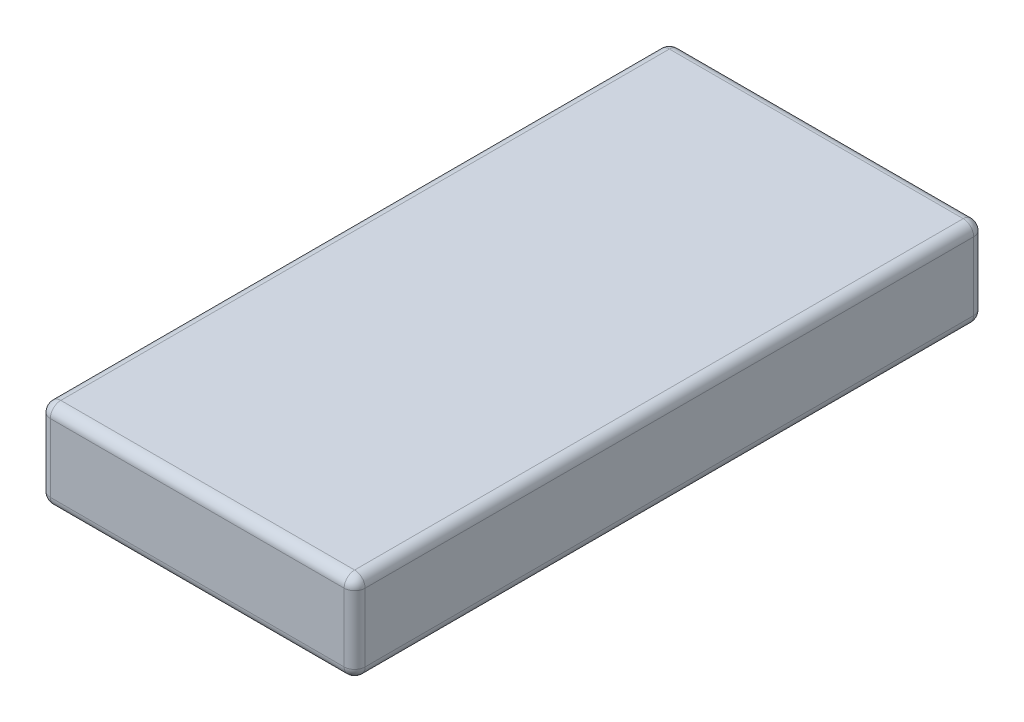
ISO-10303-21;
HEADER;
FILE_DESCRIPTION(('STEP AP214'),'2;1');
FILE_NAME('part.step','',(''),(''),'','','');
FILE_SCHEMA(('AUTOMOTIVE_DESIGN { 1 0 10303 214 1 1 1 1 }'));
ENDSEC;
DATA;
#1=APPLICATION_CONTEXT('core data for automotive mechanical design processes');
#2=APPLICATION_PROTOCOL_DEFINITION('international standard','automotive_design',2000,#1);
#3=PRODUCT_CONTEXT('',#1,'mechanical');
#4=PRODUCT('Part','Part','',(#3));
#5=PRODUCT_RELATED_PRODUCT_CATEGORY('part','',(#4));
#6=PRODUCT_DEFINITION_FORMATION('','',#4);
#7=PRODUCT_DEFINITION_CONTEXT('part definition',#1,'design');
#8=PRODUCT_DEFINITION('design','',#6,#7);
#9=PRODUCT_DEFINITION_SHAPE('','',#8);
#10=(LENGTH_UNIT() NAMED_UNIT(*) SI_UNIT(.MILLI.,.METRE.));
#11=(NAMED_UNIT(*) PLANE_ANGLE_UNIT() SI_UNIT($,.RADIAN.));
#12=(NAMED_UNIT(*) SI_UNIT($,.STERADIAN.) SOLID_ANGLE_UNIT());
#13=UNCERTAINTY_MEASURE_WITH_UNIT(LENGTH_MEASURE(1.E-05),#10,'distance_accuracy_value','');
#14=(GEOMETRIC_REPRESENTATION_CONTEXT(3) GLOBAL_UNCERTAINTY_ASSIGNED_CONTEXT((#13)) GLOBAL_UNIT_ASSIGNED_CONTEXT((#10,
#11,#12)) REPRESENTATION_CONTEXT('',''));
#15=CARTESIAN_POINT('',(0.,0.,0.));
#16=DIRECTION('',(0.,0.,1.));
#17=DIRECTION('',(1.,0.,0.));
#18=AXIS2_PLACEMENT_3D('',#15,#16,#17);
#19=CARTESIAN_POINT('',(-1.5,0.85,3.));
#20=DIRECTION('',(1.,0.,0.));
#21=DIRECTION('',(0.,0.,-1.));
#22=AXIS2_PLACEMENT_3D('',#19,#20,#21);
#23=PLANE('',#22);
#24=DIRECTION('',(0.,0.,1.));
#25=VECTOR('',#24,1.);
#26=CARTESIAN_POINT('',(-1.5,0.75,-3.));
#27=LINE('',#26,#25);
#28=CARTESIAN_POINT('',(-1.5,0.75,2.9));
#29=VERTEX_POINT('',#28);
#30=CARTESIAN_POINT('',(-1.5,0.75,-2.9));
#31=VERTEX_POINT('',#30);
#32=EDGE_CURVE('E184',#29,#31,#27,.F.);
#33=ORIENTED_EDGE('',*,*,#32,.T.);
#34=DIRECTION('',(0.,-1.,0.));
#35=VECTOR('',#34,1.);
#36=CARTESIAN_POINT('',(-1.5,0.85,-2.9));
#37=LINE('',#36,#35);
#38=CARTESIAN_POINT('',(-1.5,0.1,-2.9));
#39=VERTEX_POINT('',#38);
#40=EDGE_CURVE('E186',#31,#39,#37,.T.);
#41=ORIENTED_EDGE('',*,*,#40,.T.);
#42=DIRECTION('',(0.,0.,1.));
#43=VECTOR('',#42,1.);
#44=CARTESIAN_POINT('',(-1.5,0.1,3.));
#45=LINE('',#44,#43);
#46=CARTESIAN_POINT('',(-1.5,0.1,2.9));
#47=VERTEX_POINT('',#46);
#48=EDGE_CURVE('E182',#39,#47,#45,.T.);
#49=ORIENTED_EDGE('',*,*,#48,.T.);
#50=DIRECTION('',(0.,-1.,0.));
#51=VECTOR('',#50,1.);
#52=CARTESIAN_POINT('',(-1.5,0.85,2.9));
#53=LINE('',#52,#51);
#54=EDGE_CURVE('E180',#47,#29,#53,.F.);
#55=ORIENTED_EDGE('',*,*,#54,.T.);
#56=EDGE_LOOP('',(#33,#41,#49,#55));
#57=FACE_BOUND('',#56,.T.);
#58=ADVANCED_FACE('F32',(#57),#23,.F.);
#59=CARTESIAN_POINT('',(1.5,0.85,3.));
#60=DIRECTION('',(0.,0.,-1.));
#61=DIRECTION('',(-1.,0.,0.));
#62=AXIS2_PLACEMENT_3D('',#59,#60,#61);
#63=PLANE('',#62);
#64=DIRECTION('',(1.,0.,0.));
#65=VECTOR('',#64,1.);
#66=CARTESIAN_POINT('',(-1.5,0.75,3.));
#67=LINE('',#66,#65);
#68=CARTESIAN_POINT('',(1.4,0.75,3.));
#69=VERTEX_POINT('',#68);
#70=CARTESIAN_POINT('',(-1.4,0.75,3.));
#71=VERTEX_POINT('',#70);
#72=EDGE_CURVE('E137',#69,#71,#67,.F.);
#73=ORIENTED_EDGE('',*,*,#72,.T.);
#74=DIRECTION('',(0.,-1.,0.));
#75=VECTOR('',#74,1.);
#76=CARTESIAN_POINT('',(-1.4,0.85,3.));
#77=LINE('',#76,#75);
#78=CARTESIAN_POINT('',(-1.4,0.1,3.));
#79=VERTEX_POINT('',#78);
#80=EDGE_CURVE('E194',#71,#79,#77,.T.);
#81=ORIENTED_EDGE('',*,*,#80,.T.);
#82=DIRECTION('',(1.,0.,0.));
#83=VECTOR('',#82,1.);
#84=CARTESIAN_POINT('',(1.5,0.1,3.));
#85=LINE('',#84,#83);
#86=CARTESIAN_POINT('',(1.4,0.1,3.));
#87=VERTEX_POINT('',#86);
#88=EDGE_CURVE('E191',#79,#87,#85,.T.);
#89=ORIENTED_EDGE('',*,*,#88,.T.);
#90=DIRECTION('',(0.,-1.,0.));
#91=VECTOR('',#90,1.);
#92=CARTESIAN_POINT('',(1.4,0.85,3.));
#93=LINE('',#92,#91);
#94=EDGE_CURVE('E189',#87,#69,#93,.F.);
#95=ORIENTED_EDGE('',*,*,#94,.T.);
#96=EDGE_LOOP('',(#73,#81,#89,#95));
#97=FACE_BOUND('',#96,.T.);
#98=ADVANCED_FACE('F262',(#97),#63,.F.);
#99=CARTESIAN_POINT('',(1.5,0.85,3.));
#100=DIRECTION('',(-1.,0.,0.));
#101=DIRECTION('',(0.,0.,1.));
#102=AXIS2_PLACEMENT_3D('',#99,#100,#101);
#103=PLANE('',#102);
#104=DIRECTION('',(0.,0.,-1.));
#105=VECTOR('',#104,1.);
#106=CARTESIAN_POINT('',(1.5,0.75,3.));
#107=LINE('',#106,#105);
#108=CARTESIAN_POINT('',(1.5,0.75,-2.9));
#109=VERTEX_POINT('',#108);
#110=CARTESIAN_POINT('',(1.5,0.75,2.9));
#111=VERTEX_POINT('',#110);
#112=EDGE_CURVE('E41',#109,#111,#107,.F.);
#113=ORIENTED_EDGE('',*,*,#112,.T.);
#114=DIRECTION('',(0.,-1.,0.));
#115=VECTOR('',#114,1.);
#116=CARTESIAN_POINT('',(1.5,0.85,2.9));
#117=LINE('',#116,#115);
#118=CARTESIAN_POINT('',(1.5,0.1,2.9));
#119=VERTEX_POINT('',#118);
#120=EDGE_CURVE('E11',#111,#119,#117,.T.);
#121=ORIENTED_EDGE('',*,*,#120,.T.);
#122=DIRECTION('',(0.,0.,-1.));
#123=VECTOR('',#122,1.);
#124=CARTESIAN_POINT('',(1.5,0.1,3.));
#125=LINE('',#124,#123);
#126=CARTESIAN_POINT('',(1.5,0.1,-2.9));
#127=VERTEX_POINT('',#126);
#128=EDGE_CURVE('E197',#119,#127,#125,.T.);
#129=ORIENTED_EDGE('',*,*,#128,.T.);
#130=DIRECTION('',(0.,-1.,0.));
#131=VECTOR('',#130,1.);
#132=CARTESIAN_POINT('',(1.5,0.85,-2.9));
#133=LINE('',#132,#131);
#134=EDGE_CURVE('E52',#127,#109,#133,.F.);
#135=ORIENTED_EDGE('',*,*,#134,.T.);
#136=EDGE_LOOP('',(#113,#121,#129,#135));
#137=FACE_BOUND('',#136,.T.);
#138=ADVANCED_FACE('F307',(#137),#103,.F.);
#139=CARTESIAN_POINT('',(1.5,0.85,-3.));
#140=DIRECTION('',(0.,0.,1.));
#141=DIRECTION('',(1.,0.,0.));
#142=AXIS2_PLACEMENT_3D('',#139,#140,#141);
#143=PLANE('',#142);
#144=DIRECTION('',(-1.,0.,0.));
#145=VECTOR('',#144,1.);
#146=CARTESIAN_POINT('',(1.5,0.1,-3.));
#147=LINE('',#146,#145);
#148=CARTESIAN_POINT('',(1.4,0.1,-3.));
#149=VERTEX_POINT('',#148);
#150=CARTESIAN_POINT('',(-1.4,0.1,-3.));
#151=VERTEX_POINT('',#150);
#152=EDGE_CURVE('E164',#149,#151,#147,.T.);
#153=ORIENTED_EDGE('',*,*,#152,.T.);
#154=DIRECTION('',(0.,-1.,0.));
#155=VECTOR('',#154,1.);
#156=CARTESIAN_POINT('',(-1.4,0.85,-3.));
#157=LINE('',#156,#155);
#158=CARTESIAN_POINT('',(-1.4,0.75,-3.));
#159=VERTEX_POINT('',#158);
#160=EDGE_CURVE('E169',#151,#159,#157,.F.);
#161=ORIENTED_EDGE('',*,*,#160,.T.);
#162=DIRECTION('',(-1.,0.,0.));
#163=VECTOR('',#162,1.);
#164=CARTESIAN_POINT('',(1.5,0.75,-3.));
#165=LINE('',#164,#163);
#166=CARTESIAN_POINT('',(1.4,0.75,-3.));
#167=VERTEX_POINT('',#166);
#168=EDGE_CURVE('E166',#159,#167,#165,.F.);
#169=ORIENTED_EDGE('',*,*,#168,.T.);
#170=DIRECTION('',(0.,-1.,0.));
#171=VECTOR('',#170,1.);
#172=CARTESIAN_POINT('',(1.4,0.85,-3.));
#173=LINE('',#172,#171);
#174=EDGE_CURVE('E162',#167,#149,#173,.T.);
#175=ORIENTED_EDGE('',*,*,#174,.T.);
#176=EDGE_LOOP('',(#153,#161,#169,#175));
#177=FACE_BOUND('',#176,.T.);
#178=ADVANCED_FACE('F309',(#177),#143,.F.);
#179=CARTESIAN_POINT('',(0.,0.85,0.));
#180=DIRECTION('',(0.,1.,0.));
#181=DIRECTION('',(0.,0.,1.));
#182=AXIS2_PLACEMENT_3D('',#179,#180,#181);
#183=PLANE('',#182);
#184=DIRECTION('',(0.,0.,-1.));
#185=VECTOR('',#184,1.);
#186=CARTESIAN_POINT('',(1.4,0.85,-3.));
#187=LINE('',#186,#185);
#188=CARTESIAN_POINT('',(1.4,0.85,2.9));
#189=VERTEX_POINT('',#188);
#190=CARTESIAN_POINT('',(1.4,0.85,-2.9));
#191=VERTEX_POINT('',#190);
#192=EDGE_CURVE('E124',#189,#191,#187,.T.);
#193=ORIENTED_EDGE('',*,*,#192,.T.);
#194=DIRECTION('',(-1.,0.,0.));
#195=VECTOR('',#194,1.);
#196=CARTESIAN_POINT('',(-1.5,0.85,-2.9));
#197=LINE('',#196,#195);
#198=CARTESIAN_POINT('',(-1.4,0.85,-2.9));
#199=VERTEX_POINT('',#198);
#200=EDGE_CURVE('E160',#191,#199,#197,.T.);
#201=ORIENTED_EDGE('',*,*,#200,.T.);
#202=DIRECTION('',(0.,0.,1.));
#203=VECTOR('',#202,1.);
#204=CARTESIAN_POINT('',(-1.4,0.85,3.));
#205=LINE('',#204,#203);
#206=CARTESIAN_POINT('',(-1.4,0.85,2.9));
#207=VERTEX_POINT('',#206);
#208=EDGE_CURVE('E127',#199,#207,#205,.T.);
#209=ORIENTED_EDGE('',*,*,#208,.T.);
#210=DIRECTION('',(1.,0.,0.));
#211=VECTOR('',#210,1.);
#212=CARTESIAN_POINT('',(1.5,0.85,2.9));
#213=LINE('',#212,#211);
#214=EDGE_CURVE('E119',#207,#189,#213,.T.);
#215=ORIENTED_EDGE('',*,*,#214,.T.);
#216=EDGE_LOOP('',(#193,#201,#209,#215));
#217=FACE_BOUND('',#216,.T.);
#218=ADVANCED_FACE('F121',(#217),#183,.T.);
#219=CARTESIAN_POINT('',(0.,0.,0.));
#220=DIRECTION('',(0.,1.,0.));
#221=DIRECTION('',(0.,0.,1.));
#222=AXIS2_PLACEMENT_3D('',#219,#220,#221);
#223=PLANE('',#222);
#224=DIRECTION('',(0.,0.,1.));
#225=VECTOR('',#224,1.);
#226=CARTESIAN_POINT('',(-1.4,0.,0.));
#227=LINE('',#226,#225);
#228=CARTESIAN_POINT('',(-1.4,0.,2.9));
#229=VERTEX_POINT('',#228);
#230=CARTESIAN_POINT('',(-1.4,0.,-2.9));
#231=VERTEX_POINT('',#230);
#232=EDGE_CURVE('E175',#229,#231,#227,.F.);
#233=ORIENTED_EDGE('',*,*,#232,.T.);
#234=DIRECTION('',(-1.,0.,0.));
#235=VECTOR('',#234,1.);
#236=CARTESIAN_POINT('',(0.,0.,-2.9));
#237=LINE('',#236,#235);
#238=CARTESIAN_POINT('',(1.4,0.,-2.9));
#239=VERTEX_POINT('',#238);
#240=EDGE_CURVE('E177',#231,#239,#237,.F.);
#241=ORIENTED_EDGE('',*,*,#240,.T.);
#242=DIRECTION('',(0.,0.,-1.));
#243=VECTOR('',#242,1.);
#244=CARTESIAN_POINT('',(1.4,0.,0.));
#245=LINE('',#244,#243);
#246=CARTESIAN_POINT('',(1.4,0.,2.9));
#247=VERTEX_POINT('',#246);
#248=EDGE_CURVE('E171',#239,#247,#245,.F.);
#249=ORIENTED_EDGE('',*,*,#248,.T.);
#250=DIRECTION('',(1.,0.,0.));
#251=VECTOR('',#250,1.);
#252=CARTESIAN_POINT('',(0.,0.,2.9));
#253=LINE('',#252,#251);
#254=EDGE_CURVE('E173',#247,#229,#253,.F.);
#255=ORIENTED_EDGE('',*,*,#254,.T.);
#256=EDGE_LOOP('',(#233,#241,#249,#255));
#257=FACE_BOUND('',#256,.T.);
#258=ADVANCED_FACE('F290',(#257),#223,.F.);
#259=CARTESIAN_POINT('',(1.5,0.1,2.9));
#260=DIRECTION('',(1.,0.,0.));
#261=DIRECTION('',(0.,0.,-1.));
#262=AXIS2_PLACEMENT_3D('',#259,#260,#261);
#263=CYLINDRICAL_SURFACE('',#262,0.1);
#264=CARTESIAN_POINT('',(1.4,0.1,2.9));
#265=DIRECTION('',(1.,0.,0.));
#266=DIRECTION('',(0.,0.,-1.));
#267=AXIS2_PLACEMENT_3D('',#264,#265,#266);
#268=CIRCLE('',#267,0.1);
#269=EDGE_CURVE('E36',#87,#247,#268,.T.);
#270=ORIENTED_EDGE('',*,*,#269,.F.);
#271=ORIENTED_EDGE('',*,*,#88,.F.);
#272=CARTESIAN_POINT('',(-1.4,0.1,2.9));
#273=DIRECTION('',(-1.,0.,0.));
#274=DIRECTION('',(0.,0.,1.));
#275=AXIS2_PLACEMENT_3D('',#272,#273,#274);
#276=CIRCLE('',#275,0.1);
#277=EDGE_CURVE('E157',#229,#79,#276,.T.);
#278=ORIENTED_EDGE('',*,*,#277,.F.);
#279=ORIENTED_EDGE('',*,*,#254,.F.);
#280=EDGE_LOOP('',(#270,#271,#278,#279));
#281=FACE_BOUND('',#280,.T.);
#282=ADVANCED_FACE('F34',(#281),#263,.T.);
#283=CARTESIAN_POINT('',(1.4,0.1,2.9));
#284=DIRECTION('',(0.,0.,1.));
#285=DIRECTION('',(1.,0.,0.));
#286=AXIS2_PLACEMENT_3D('',#283,#284,#285);
#287=SPHERICAL_SURFACE('',#286,0.1);
#288=CARTESIAN_POINT('',(1.4,0.1,2.9));
#289=DIRECTION('',(0.,-1.,0.));
#290=DIRECTION('',(0.,0.,-1.));
#291=AXIS2_PLACEMENT_3D('',#288,#289,#290);
#292=CIRCLE('',#291,0.1);
#293=EDGE_CURVE('E242',#87,#119,#292,.F.);
#294=ORIENTED_EDGE('',*,*,#293,.F.);
#295=ORIENTED_EDGE('',*,*,#269,.T.);
#296=CARTESIAN_POINT('',(1.4,0.1,2.9));
#297=DIRECTION('',(0.,0.,1.));
#298=DIRECTION('',(1.,0.,0.));
#299=AXIS2_PLACEMENT_3D('',#296,#297,#298);
#300=CIRCLE('',#299,0.1);
#301=EDGE_CURVE('E245',#119,#247,#300,.F.);
#302=ORIENTED_EDGE('',*,*,#301,.F.);
#303=EDGE_LOOP('',(#294,#295,#302));
#304=FACE_BOUND('',#303,.T.);
#305=ADVANCED_FACE('F303',(#304),#287,.T.);
#306=CARTESIAN_POINT('',(-1.4,0.1,2.9));
#307=DIRECTION('',(0.,0.,1.));
#308=DIRECTION('',(1.,0.,0.));
#309=AXIS2_PLACEMENT_3D('',#306,#307,#308);
#310=SPHERICAL_SURFACE('',#309,0.1);
#311=CARTESIAN_POINT('',(-1.4,0.1,2.9));
#312=DIRECTION('',(0.,0.,1.));
#313=DIRECTION('',(1.,0.,0.));
#314=AXIS2_PLACEMENT_3D('',#311,#312,#313);
#315=CIRCLE('',#314,0.1);
#316=EDGE_CURVE('E237',#229,#47,#315,.F.);
#317=ORIENTED_EDGE('',*,*,#316,.F.);
#318=ORIENTED_EDGE('',*,*,#277,.T.);
#319=CARTESIAN_POINT('',(-1.4,0.1,2.9));
#320=DIRECTION('',(0.,-1.,0.));
#321=DIRECTION('',(0.,0.,-1.));
#322=AXIS2_PLACEMENT_3D('',#319,#320,#321);
#323=CIRCLE('',#322,0.1);
#324=EDGE_CURVE('E240',#47,#79,#323,.F.);
#325=ORIENTED_EDGE('',*,*,#324,.F.);
#326=EDGE_LOOP('',(#317,#318,#325));
#327=FACE_BOUND('',#326,.T.);
#328=ADVANCED_FACE('F253',(#327),#310,.T.);
#329=CARTESIAN_POINT('',(1.4,0.1,3.));
#330=DIRECTION('',(0.,0.,-1.));
#331=DIRECTION('',(-1.,0.,0.));
#332=AXIS2_PLACEMENT_3D('',#329,#330,#331);
#333=CYLINDRICAL_SURFACE('',#332,0.1);
#334=ORIENTED_EDGE('',*,*,#301,.T.);
#335=ORIENTED_EDGE('',*,*,#248,.F.);
#336=CARTESIAN_POINT('',(1.4,0.1,-2.9));
#337=DIRECTION('',(0.,0.,-1.));
#338=DIRECTION('',(-1.,0.,0.));
#339=AXIS2_PLACEMENT_3D('',#336,#337,#338);
#340=CIRCLE('',#339,0.1);
#341=EDGE_CURVE('E232',#127,#239,#340,.T.);
#342=ORIENTED_EDGE('',*,*,#341,.F.);
#343=ORIENTED_EDGE('',*,*,#128,.F.);
#344=EDGE_LOOP('',(#334,#335,#342,#343));
#345=FACE_BOUND('',#344,.T.);
#346=ADVANCED_FACE('F300',(#345),#333,.T.);
#347=CARTESIAN_POINT('',(1.4,0.85,2.9));
#348=DIRECTION('',(0.,-1.,0.));
#349=DIRECTION('',(0.,0.,-1.));
#350=AXIS2_PLACEMENT_3D('',#347,#348,#349);
#351=CYLINDRICAL_SURFACE('',#350,0.1);
#352=ORIENTED_EDGE('',*,*,#293,.T.);
#353=ORIENTED_EDGE('',*,*,#120,.F.);
#354=CARTESIAN_POINT('',(1.4,0.75,2.9));
#355=DIRECTION('',(0.,1.,0.));
#356=DIRECTION('',(0.,0.,1.));
#357=AXIS2_PLACEMENT_3D('',#354,#355,#356);
#358=CIRCLE('',#357,0.1);
#359=EDGE_CURVE('E141',#69,#111,#358,.T.);
#360=ORIENTED_EDGE('',*,*,#359,.F.);
#361=ORIENTED_EDGE('',*,*,#94,.F.);
#362=EDGE_LOOP('',(#352,#353,#360,#361));
#363=FACE_BOUND('',#362,.T.);
#364=ADVANCED_FACE('F306',(#363),#351,.T.);
#365=CARTESIAN_POINT('',(0.,0.75,2.9));
#366=DIRECTION('',(-1.,0.,0.));
#367=DIRECTION('',(0.,0.,1.));
#368=AXIS2_PLACEMENT_3D('',#365,#366,#367);
#369=CYLINDRICAL_SURFACE('',#368,0.1);
#370=CARTESIAN_POINT('',(-1.4,0.75,2.9));
#371=DIRECTION('',(-1.,0.,0.));
#372=DIRECTION('',(0.,-1.,0.));
#373=AXIS2_PLACEMENT_3D('',#370,#371,#372);
#374=CIRCLE('',#373,0.1);
#375=EDGE_CURVE('E142',#71,#207,#374,.T.);
#376=ORIENTED_EDGE('',*,*,#375,.F.);
#377=ORIENTED_EDGE('',*,*,#72,.F.);
#378=CARTESIAN_POINT('',(1.4,0.75,2.9));
#379=DIRECTION('',(1.,0.,0.));
#380=DIRECTION('',(0.,0.,-1.));
#381=AXIS2_PLACEMENT_3D('',#378,#379,#380);
#382=CIRCLE('',#381,0.1);
#383=EDGE_CURVE('E134',#189,#69,#382,.T.);
#384=ORIENTED_EDGE('',*,*,#383,.F.);
#385=ORIENTED_EDGE('',*,*,#214,.F.);
#386=EDGE_LOOP('',(#376,#377,#384,#385));
#387=FACE_BOUND('',#386,.T.);
#388=ADVANCED_FACE('F136',(#387),#369,.T.);
#389=CARTESIAN_POINT('',(-1.4,0.85,2.9));
#390=DIRECTION('',(0.,-1.,0.));
#391=DIRECTION('',(0.,0.,-1.));
#392=AXIS2_PLACEMENT_3D('',#389,#390,#391);
#393=CYLINDRICAL_SURFACE('',#392,0.1);
#394=ORIENTED_EDGE('',*,*,#324,.T.);
#395=ORIENTED_EDGE('',*,*,#80,.F.);
#396=CARTESIAN_POINT('',(-1.4,0.75,2.9));
#397=DIRECTION('',(0.,1.,0.));
#398=DIRECTION('',(0.,0.,1.));
#399=AXIS2_PLACEMENT_3D('',#396,#397,#398);
#400=CIRCLE('',#399,0.1);
#401=EDGE_CURVE('E227',#29,#71,#400,.T.);
#402=ORIENTED_EDGE('',*,*,#401,.F.);
#403=ORIENTED_EDGE('',*,*,#54,.F.);
#404=EDGE_LOOP('',(#394,#395,#402,#403));
#405=FACE_BOUND('',#404,.T.);
#406=ADVANCED_FACE('F265',(#405),#393,.T.);
#407=CARTESIAN_POINT('',(-1.4,0.1,3.));
#408=DIRECTION('',(0.,0.,1.));
#409=DIRECTION('',(1.,0.,0.));
#410=AXIS2_PLACEMENT_3D('',#407,#408,#409);
#411=CYLINDRICAL_SURFACE('',#410,0.1);
#412=ORIENTED_EDGE('',*,*,#316,.T.);
#413=ORIENTED_EDGE('',*,*,#48,.F.);
#414=CARTESIAN_POINT('',(-1.4,0.1,-2.9));
#415=DIRECTION('',(0.,0.,-1.));
#416=DIRECTION('',(-1.,0.,0.));
#417=AXIS2_PLACEMENT_3D('',#414,#415,#416);
#418=CIRCLE('',#417,0.1);
#419=EDGE_CURVE('E224',#231,#39,#418,.T.);
#420=ORIENTED_EDGE('',*,*,#419,.F.);
#421=ORIENTED_EDGE('',*,*,#232,.F.);
#422=EDGE_LOOP('',(#412,#413,#420,#421));
#423=FACE_BOUND('',#422,.T.);
#424=ADVANCED_FACE('F287',(#423),#411,.T.);
#425=CARTESIAN_POINT('',(1.5,0.1,-2.9));
#426=DIRECTION('',(-1.,0.,0.));
#427=DIRECTION('',(0.,0.,1.));
#428=AXIS2_PLACEMENT_3D('',#425,#426,#427);
#429=CYLINDRICAL_SURFACE('',#428,0.1);
#430=CARTESIAN_POINT('',(1.4,0.1,-2.9));
#431=DIRECTION('',(1.,0.,0.));
#432=DIRECTION('',(0.,0.,-1.));
#433=AXIS2_PLACEMENT_3D('',#430,#431,#432);
#434=CIRCLE('',#433,0.1);
#435=EDGE_CURVE('E234',#239,#149,#434,.T.);
#436=ORIENTED_EDGE('',*,*,#435,.F.);
#437=ORIENTED_EDGE('',*,*,#240,.F.);
#438=CARTESIAN_POINT('',(-1.4,0.1,-2.9));
#439=DIRECTION('',(-1.,0.,0.));
#440=DIRECTION('',(0.,0.,1.));
#441=AXIS2_PLACEMENT_3D('',#438,#439,#440);
#442=CIRCLE('',#441,0.1);
#443=EDGE_CURVE('E221',#151,#231,#442,.T.);
#444=ORIENTED_EDGE('',*,*,#443,.F.);
#445=ORIENTED_EDGE('',*,*,#152,.F.);
#446=EDGE_LOOP('',(#436,#437,#444,#445));
#447=FACE_BOUND('',#446,.T.);
#448=ADVANCED_FACE('F293',(#447),#429,.T.);
#449=CARTESIAN_POINT('',(1.4,0.1,-2.9));
#450=DIRECTION('',(0.,0.,1.));
#451=DIRECTION('',(1.,0.,0.));
#452=AXIS2_PLACEMENT_3D('',#449,#450,#451);
#453=SPHERICAL_SURFACE('',#452,0.1);
#454=ORIENTED_EDGE('',*,*,#341,.T.);
#455=ORIENTED_EDGE('',*,*,#435,.T.);
#456=CARTESIAN_POINT('',(1.4,0.1,-2.9));
#457=DIRECTION('',(0.,-1.,0.));
#458=DIRECTION('',(0.,0.,-1.));
#459=AXIS2_PLACEMENT_3D('',#456,#457,#458);
#460=CIRCLE('',#459,0.1);
#461=EDGE_CURVE('E148',#127,#149,#460,.F.);
#462=ORIENTED_EDGE('',*,*,#461,.F.);
#463=EDGE_LOOP('',(#454,#455,#462));
#464=FACE_BOUND('',#463,.T.);
#465=ADVANCED_FACE('F351',(#464),#453,.T.);
#466=CARTESIAN_POINT('',(1.4,0.75,2.9));
#467=DIRECTION('',(0.,0.,1.));
#468=DIRECTION('',(1.,0.,0.));
#469=AXIS2_PLACEMENT_3D('',#466,#467,#468);
#470=SPHERICAL_SURFACE('',#469,0.1);
#471=ORIENTED_EDGE('',*,*,#383,.T.);
#472=ORIENTED_EDGE('',*,*,#359,.T.);
#473=CARTESIAN_POINT('',(1.4,0.75,2.9));
#474=DIRECTION('',(0.,0.,1.));
#475=DIRECTION('',(1.,0.,0.));
#476=AXIS2_PLACEMENT_3D('',#473,#474,#475);
#477=CIRCLE('',#476,0.1);
#478=EDGE_CURVE('E145',#189,#111,#477,.F.);
#479=ORIENTED_EDGE('',*,*,#478,.F.);
#480=EDGE_LOOP('',(#471,#472,#479));
#481=FACE_BOUND('',#480,.T.);
#482=ADVANCED_FACE('F146',(#481),#470,.T.);
#483=CARTESIAN_POINT('',(-1.4,0.75,2.9));
#484=DIRECTION('',(0.,0.,1.));
#485=DIRECTION('',(1.,0.,0.));
#486=AXIS2_PLACEMENT_3D('',#483,#484,#485);
#487=SPHERICAL_SURFACE('',#486,0.1);
#488=ORIENTED_EDGE('',*,*,#401,.T.);
#489=ORIENTED_EDGE('',*,*,#375,.T.);
#490=CARTESIAN_POINT('',(-1.4,0.75,2.9));
#491=DIRECTION('',(0.,0.,1.));
#492=DIRECTION('',(1.,0.,0.));
#493=AXIS2_PLACEMENT_3D('',#490,#491,#492);
#494=CIRCLE('',#493,0.1);
#495=EDGE_CURVE('E149',#29,#207,#494,.F.);
#496=ORIENTED_EDGE('',*,*,#495,.F.);
#497=EDGE_LOOP('',(#488,#489,#496));
#498=FACE_BOUND('',#497,.T.);
#499=ADVANCED_FACE('F268',(#498),#487,.T.);
#500=CARTESIAN_POINT('',(-1.4,0.1,-2.9));
#501=DIRECTION('',(0.,0.,1.));
#502=DIRECTION('',(1.,0.,0.));
#503=AXIS2_PLACEMENT_3D('',#500,#501,#502);
#504=SPHERICAL_SURFACE('',#503,0.1);
#505=ORIENTED_EDGE('',*,*,#443,.T.);
#506=ORIENTED_EDGE('',*,*,#419,.T.);
#507=CARTESIAN_POINT('',(-1.4,0.1,-2.9));
#508=DIRECTION('',(0.,-1.,0.));
#509=DIRECTION('',(0.,0.,-1.));
#510=AXIS2_PLACEMENT_3D('',#507,#508,#509);
#511=CIRCLE('',#510,0.1);
#512=EDGE_CURVE('E215',#151,#39,#511,.F.);
#513=ORIENTED_EDGE('',*,*,#512,.F.);
#514=EDGE_LOOP('',(#505,#506,#513));
#515=FACE_BOUND('',#514,.T.);
#516=ADVANCED_FACE('F284',(#515),#504,.T.);
#517=CARTESIAN_POINT('',(1.4,0.85,-2.9));
#518=DIRECTION('',(0.,-1.,0.));
#519=DIRECTION('',(0.,0.,-1.));
#520=AXIS2_PLACEMENT_3D('',#517,#518,#519);
#521=CYLINDRICAL_SURFACE('',#520,0.1);
#522=ORIENTED_EDGE('',*,*,#461,.T.);
#523=ORIENTED_EDGE('',*,*,#174,.F.);
#524=CARTESIAN_POINT('',(1.4,0.75,-2.9));
#525=DIRECTION('',(0.,1.,0.));
#526=DIRECTION('',(0.,0.,1.));
#527=AXIS2_PLACEMENT_3D('',#524,#525,#526);
#528=CIRCLE('',#527,0.1);
#529=EDGE_CURVE('E212',#109,#167,#528,.T.);
#530=ORIENTED_EDGE('',*,*,#529,.F.);
#531=ORIENTED_EDGE('',*,*,#134,.F.);
#532=EDGE_LOOP('',(#522,#523,#530,#531));
#533=FACE_BOUND('',#532,.T.);
#534=ADVANCED_FACE('F341',(#533),#521,.T.);
#535=CARTESIAN_POINT('',(1.4,0.75,0.));
#536=DIRECTION('',(0.,0.,1.));
#537=DIRECTION('',(1.,0.,0.));
#538=AXIS2_PLACEMENT_3D('',#535,#536,#537);
#539=CYLINDRICAL_SURFACE('',#538,0.1);
#540=ORIENTED_EDGE('',*,*,#478,.T.);
#541=ORIENTED_EDGE('',*,*,#112,.F.);
#542=CARTESIAN_POINT('',(1.4,0.75,-2.9));
#543=DIRECTION('',(0.,0.,-1.));
#544=DIRECTION('',(-1.,0.,0.));
#545=AXIS2_PLACEMENT_3D('',#542,#543,#544);
#546=CIRCLE('',#545,0.1);
#547=EDGE_CURVE('E153',#191,#109,#546,.T.);
#548=ORIENTED_EDGE('',*,*,#547,.F.);
#549=ORIENTED_EDGE('',*,*,#192,.F.);
#550=EDGE_LOOP('',(#540,#541,#548,#549));
#551=FACE_BOUND('',#550,.T.);
#552=ADVANCED_FACE('F151',(#551),#539,.T.);
#553=CARTESIAN_POINT('',(-1.4,0.75,0.));
#554=DIRECTION('',(0.,0.,-1.));
#555=DIRECTION('',(-1.,0.,0.));
#556=AXIS2_PLACEMENT_3D('',#553,#554,#555);
#557=CYLINDRICAL_SURFACE('',#556,0.1);
#558=ORIENTED_EDGE('',*,*,#495,.T.);
#559=ORIENTED_EDGE('',*,*,#208,.F.);
#560=CARTESIAN_POINT('',(-1.4,0.75,-2.9));
#561=DIRECTION('',(0.,0.,-1.));
#562=DIRECTION('',(0.,1.,0.));
#563=AXIS2_PLACEMENT_3D('',#560,#561,#562);
#564=CIRCLE('',#563,0.1);
#565=EDGE_CURVE('E208',#31,#199,#564,.T.);
#566=ORIENTED_EDGE('',*,*,#565,.F.);
#567=ORIENTED_EDGE('',*,*,#32,.F.);
#568=EDGE_LOOP('',(#558,#559,#566,#567));
#569=FACE_BOUND('',#568,.T.);
#570=ADVANCED_FACE('F272',(#569),#557,.T.);
#571=CARTESIAN_POINT('',(-1.4,0.85,-2.9));
#572=DIRECTION('',(0.,-1.,0.));
#573=DIRECTION('',(0.,0.,-1.));
#574=AXIS2_PLACEMENT_3D('',#571,#572,#573);
#575=CYLINDRICAL_SURFACE('',#574,0.1);
#576=ORIENTED_EDGE('',*,*,#512,.T.);
#577=ORIENTED_EDGE('',*,*,#40,.F.);
#578=CARTESIAN_POINT('',(-1.4,0.75,-2.9));
#579=DIRECTION('',(0.,1.,0.));
#580=DIRECTION('',(0.,0.,1.));
#581=AXIS2_PLACEMENT_3D('',#578,#579,#580);
#582=CIRCLE('',#581,0.1);
#583=EDGE_CURVE('E205',#159,#31,#582,.T.);
#584=ORIENTED_EDGE('',*,*,#583,.F.);
#585=ORIENTED_EDGE('',*,*,#160,.F.);
#586=EDGE_LOOP('',(#576,#577,#584,#585));
#587=FACE_BOUND('',#586,.T.);
#588=ADVANCED_FACE('F277',(#587),#575,.T.);
#589=CARTESIAN_POINT('',(1.4,0.75,-2.9));
#590=DIRECTION('',(0.,0.,1.));
#591=DIRECTION('',(1.,0.,0.));
#592=AXIS2_PLACEMENT_3D('',#589,#590,#591);
#593=SPHERICAL_SURFACE('',#592,0.1);
#594=ORIENTED_EDGE('',*,*,#547,.T.);
#595=ORIENTED_EDGE('',*,*,#529,.T.);
#596=CARTESIAN_POINT('',(1.4,0.75,-2.9));
#597=DIRECTION('',(1.,0.,0.));
#598=DIRECTION('',(0.,0.,-1.));
#599=AXIS2_PLACEMENT_3D('',#596,#597,#598);
#600=CIRCLE('',#599,0.1);
#601=EDGE_CURVE('E203',#191,#167,#600,.F.);
#602=ORIENTED_EDGE('',*,*,#601,.F.);
#603=EDGE_LOOP('',(#594,#595,#602));
#604=FACE_BOUND('',#603,.T.);
#605=ADVANCED_FACE('F330',(#604),#593,.T.);
#606=CARTESIAN_POINT('',(-1.4,0.75,-2.9));
#607=DIRECTION('',(0.,0.,1.));
#608=DIRECTION('',(1.,0.,0.));
#609=AXIS2_PLACEMENT_3D('',#606,#607,#608);
#610=SPHERICAL_SURFACE('',#609,0.1);
#611=ORIENTED_EDGE('',*,*,#583,.T.);
#612=ORIENTED_EDGE('',*,*,#565,.T.);
#613=CARTESIAN_POINT('',(-1.4,0.75,-2.9));
#614=DIRECTION('',(-1.,0.,0.));
#615=DIRECTION('',(0.,0.,1.));
#616=AXIS2_PLACEMENT_3D('',#613,#614,#615);
#617=CIRCLE('',#616,0.1);
#618=EDGE_CURVE('E201',#159,#199,#617,.F.);
#619=ORIENTED_EDGE('',*,*,#618,.F.);
#620=EDGE_LOOP('',(#611,#612,#619));
#621=FACE_BOUND('',#620,.T.);
#622=ADVANCED_FACE('F326',(#621),#610,.T.);
#623=CARTESIAN_POINT('',(0.,0.75,-2.9));
#624=DIRECTION('',(1.,0.,0.));
#625=DIRECTION('',(0.,0.,-1.));
#626=AXIS2_PLACEMENT_3D('',#623,#624,#625);
#627=CYLINDRICAL_SURFACE('',#626,0.1);
#628=ORIENTED_EDGE('',*,*,#601,.T.);
#629=ORIENTED_EDGE('',*,*,#168,.F.);
#630=ORIENTED_EDGE('',*,*,#618,.T.);
#631=ORIENTED_EDGE('',*,*,#200,.F.);
#632=EDGE_LOOP('',(#628,#629,#630,#631));
#633=FACE_BOUND('',#632,.T.);
#634=ADVANCED_FACE('F323',(#633),#627,.T.);
#635=CLOSED_SHELL('',(#58,#98,#138,#178,#218,#258,#282,#305,#328,#346,#364,#388,#406,#424,#448,
#465,#482,#499,#516,#534,#552,#570,#588,#605,#622,#634));
#636=MANIFOLD_SOLID_BREP('B2',#635);
#637=ADVANCED_BREP_SHAPE_REPRESENTATION('',(#18,#636),#14);
#638=SHAPE_DEFINITION_REPRESENTATION(#9,#637);
ENDSEC;
END-ISO-10303-21;
